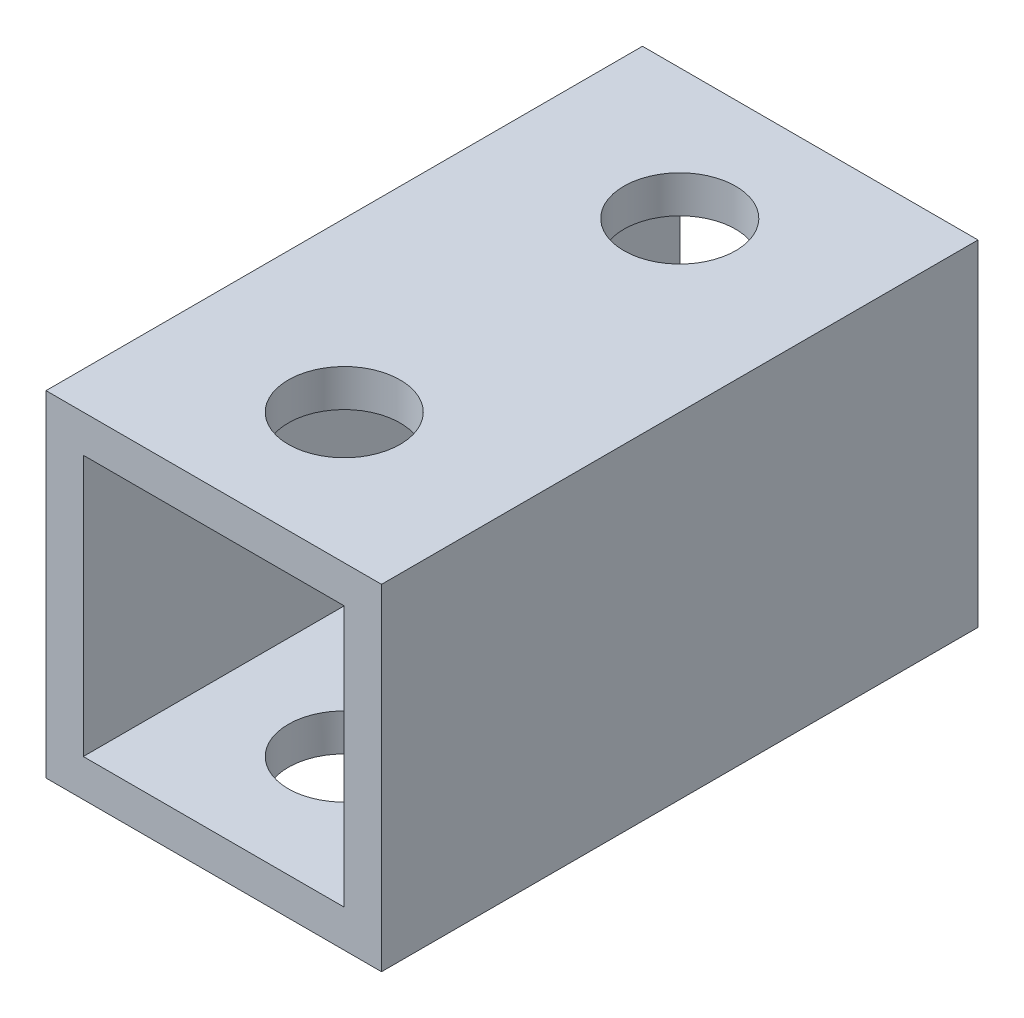
ISO-10303-21;
HEADER;
FILE_DESCRIPTION(('STEP AP214'),'2;1');
FILE_NAME('part.step','',(''),(''),'','','');
FILE_SCHEMA(('AUTOMOTIVE_DESIGN { 1 0 10303 214 1 1 1 1 }'));
ENDSEC;
DATA;
#1=APPLICATION_CONTEXT('core data for automotive mechanical design processes');
#2=APPLICATION_PROTOCOL_DEFINITION('international standard','automotive_design',2000,#1);
#3=PRODUCT_CONTEXT('',#1,'mechanical');
#4=PRODUCT('Part','Part','',(#3));
#5=PRODUCT_RELATED_PRODUCT_CATEGORY('part','',(#4));
#6=PRODUCT_DEFINITION_FORMATION('','',#4);
#7=PRODUCT_DEFINITION_CONTEXT('part definition',#1,'design');
#8=PRODUCT_DEFINITION('design','',#6,#7);
#9=PRODUCT_DEFINITION_SHAPE('','',#8);
#10=(LENGTH_UNIT() NAMED_UNIT(*) SI_UNIT(.MILLI.,.METRE.));
#11=(NAMED_UNIT(*) PLANE_ANGLE_UNIT() SI_UNIT($,.RADIAN.));
#12=(NAMED_UNIT(*) SI_UNIT($,.STERADIAN.) SOLID_ANGLE_UNIT());
#13=UNCERTAINTY_MEASURE_WITH_UNIT(LENGTH_MEASURE(1.E-05),#10,'distance_accuracy_value','');
#14=(GEOMETRIC_REPRESENTATION_CONTEXT(3) GLOBAL_UNCERTAINTY_ASSIGNED_CONTEXT((#13)) GLOBAL_UNIT_ASSIGNED_CONTEXT((#10,
#11,#12)) REPRESENTATION_CONTEXT('',''));
#15=CARTESIAN_POINT('',(0.,0.,0.));
#16=DIRECTION('',(0.,0.,1.));
#17=DIRECTION('',(1.,0.,0.));
#18=AXIS2_PLACEMENT_3D('',#15,#16,#17);
#19=CARTESIAN_POINT('',(4.5,4.5,16.));
#20=DIRECTION('',(-1.,0.,0.));
#21=DIRECTION('',(0.,0.,1.));
#22=AXIS2_PLACEMENT_3D('',#19,#20,#21);
#23=PLANE('',#22);
#24=DIRECTION('',(0.,1.,0.));
#25=VECTOR('',#24,1.);
#26=CARTESIAN_POINT('',(4.5,4.5,0.));
#27=LINE('',#26,#25);
#28=CARTESIAN_POINT('',(4.5,-4.5,0.));
#29=VERTEX_POINT('',#28);
#30=CARTESIAN_POINT('',(4.5,4.5,0.));
#31=VERTEX_POINT('',#30);
#32=EDGE_CURVE('E126',#29,#31,#27,.T.);
#33=ORIENTED_EDGE('',*,*,#32,.T.);
#34=DIRECTION('',(0.,0.,-1.));
#35=VECTOR('',#34,1.);
#36=CARTESIAN_POINT('',(4.5,4.5,16.));
#37=LINE('',#36,#35);
#38=CARTESIAN_POINT('',(4.5,4.5,16.));
#39=VERTEX_POINT('',#38);
#40=EDGE_CURVE('E155',#39,#31,#37,.T.);
#41=ORIENTED_EDGE('',*,*,#40,.F.);
#42=DIRECTION('',(0.,1.,0.));
#43=VECTOR('',#42,1.);
#44=CARTESIAN_POINT('',(4.5,4.5,16.));
#45=LINE('',#44,#43);
#46=CARTESIAN_POINT('',(4.5,-4.5,16.));
#47=VERTEX_POINT('',#46);
#48=EDGE_CURVE('E129',#47,#39,#45,.T.);
#49=ORIENTED_EDGE('',*,*,#48,.F.);
#50=DIRECTION('',(0.,0.,-1.));
#51=VECTOR('',#50,1.);
#52=CARTESIAN_POINT('',(4.5,-4.5,16.));
#53=LINE('',#52,#51);
#54=EDGE_CURVE('E139',#47,#29,#53,.T.);
#55=ORIENTED_EDGE('',*,*,#54,.T.);
#56=EDGE_LOOP('',(#33,#41,#49,#55));
#57=FACE_BOUND('',#56,.T.);
#58=ADVANCED_FACE('F34',(#57),#23,.F.);
#59=CARTESIAN_POINT('',(-4.5,4.5,16.));
#60=DIRECTION('',(0.,-1.,0.));
#61=DIRECTION('',(0.,0.,-1.));
#62=AXIS2_PLACEMENT_3D('',#59,#60,#61);
#63=PLANE('',#62);
#64=CARTESIAN_POINT('',(0.,4.5,3.5));
#65=DIRECTION('',(0.,1.,0.));
#66=DIRECTION('',(0.,0.,1.));
#67=AXIS2_PLACEMENT_3D('',#64,#65,#66);
#68=CIRCLE('',#67,1.5);
#69=CARTESIAN_POINT('',(0.,4.5,5.));
#70=VERTEX_POINT('',#69);
#71=EDGE_CURVE('E165',#70,#70,#68,.T.);
#72=ORIENTED_EDGE('',*,*,#71,.F.);
#73=EDGE_LOOP('',(#72));
#74=FACE_BOUND('',#73,.T.);
#75=CARTESIAN_POINT('',(0.,4.5,12.5));
#76=DIRECTION('',(0.,1.,0.));
#77=DIRECTION('',(0.,0.,1.));
#78=AXIS2_PLACEMENT_3D('',#75,#76,#77);
#79=CIRCLE('',#78,1.49960509591332);
#80=CARTESIAN_POINT('',(0.,4.5,13.9996050959133));
#81=VERTEX_POINT('',#80);
#82=EDGE_CURVE('E172',#81,#81,#79,.T.);
#83=ORIENTED_EDGE('',*,*,#82,.F.);
#84=EDGE_LOOP('',(#83));
#85=FACE_BOUND('',#84,.T.);
#86=DIRECTION('',(-1.,0.,0.));
#87=VECTOR('',#86,1.);
#88=CARTESIAN_POINT('',(-4.5,4.5,0.));
#89=LINE('',#88,#87);
#90=CARTESIAN_POINT('',(-4.5,4.5,0.));
#91=VERTEX_POINT('',#90);
#92=EDGE_CURVE('E142',#31,#91,#89,.T.);
#93=ORIENTED_EDGE('',*,*,#92,.T.);
#94=DIRECTION('',(0.,0.,-1.));
#95=VECTOR('',#94,1.);
#96=CARTESIAN_POINT('',(-4.5,4.5,16.));
#97=LINE('',#96,#95);
#98=CARTESIAN_POINT('',(-4.5,4.5,16.));
#99=VERTEX_POINT('',#98);
#100=EDGE_CURVE('E152',#99,#91,#97,.T.);
#101=ORIENTED_EDGE('',*,*,#100,.F.);
#102=DIRECTION('',(-1.,0.,0.));
#103=VECTOR('',#102,1.);
#104=CARTESIAN_POINT('',(-4.5,4.5,16.));
#105=LINE('',#104,#103);
#106=EDGE_CURVE('E132',#39,#99,#105,.T.);
#107=ORIENTED_EDGE('',*,*,#106,.F.);
#108=ORIENTED_EDGE('',*,*,#40,.T.);
#109=EDGE_LOOP('',(#93,#101,#107,#108));
#110=FACE_BOUND('',#109,.T.);
#111=ADVANCED_FACE('F206',(#74,#85,#110),#63,.F.);
#112=CARTESIAN_POINT('',(-4.5,4.5,16.));
#113=DIRECTION('',(1.,0.,0.));
#114=DIRECTION('',(0.,1.,0.));
#115=AXIS2_PLACEMENT_3D('',#112,#113,#114);
#116=PLANE('',#115);
#117=DIRECTION('',(0.,-1.,0.));
#118=VECTOR('',#117,1.);
#119=CARTESIAN_POINT('',(-4.5,4.5,0.));
#120=LINE('',#119,#118);
#121=CARTESIAN_POINT('',(-4.5,-4.5,0.));
#122=VERTEX_POINT('',#121);
#123=EDGE_CURVE('E144',#91,#122,#120,.T.);
#124=ORIENTED_EDGE('',*,*,#123,.T.);
#125=DIRECTION('',(0.,0.,-1.));
#126=VECTOR('',#125,1.);
#127=CARTESIAN_POINT('',(-4.5,-4.5,16.));
#128=LINE('',#127,#126);
#129=CARTESIAN_POINT('',(-4.5,-4.5,16.));
#130=VERTEX_POINT('',#129);
#131=EDGE_CURVE('E149',#130,#122,#128,.T.);
#132=ORIENTED_EDGE('',*,*,#131,.F.);
#133=DIRECTION('',(0.,-1.,0.));
#134=VECTOR('',#133,1.);
#135=CARTESIAN_POINT('',(-4.5,4.5,16.));
#136=LINE('',#135,#134);
#137=EDGE_CURVE('E135',#99,#130,#136,.T.);
#138=ORIENTED_EDGE('',*,*,#137,.F.);
#139=ORIENTED_EDGE('',*,*,#100,.T.);
#140=EDGE_LOOP('',(#124,#132,#138,#139));
#141=FACE_BOUND('',#140,.T.);
#142=ADVANCED_FACE('F211',(#141),#116,.F.);
#143=CARTESIAN_POINT('',(-4.5,-4.5,16.));
#144=DIRECTION('',(0.,1.,0.));
#145=DIRECTION('',(0.,0.,1.));
#146=AXIS2_PLACEMENT_3D('',#143,#144,#145);
#147=PLANE('',#146);
#148=CARTESIAN_POINT('',(0.,-4.5,3.5));
#149=DIRECTION('',(0.,1.,0.));
#150=DIRECTION('',(0.,0.,1.));
#151=AXIS2_PLACEMENT_3D('',#148,#149,#150);
#152=CIRCLE('',#151,1.5);
#153=CARTESIAN_POINT('',(0.,-4.5,5.));
#154=VERTEX_POINT('',#153);
#155=EDGE_CURVE('E184',#154,#154,#152,.T.);
#156=ORIENTED_EDGE('',*,*,#155,.T.);
#157=EDGE_LOOP('',(#156));
#158=FACE_BOUND('',#157,.T.);
#159=CARTESIAN_POINT('',(0.,-4.5,12.5));
#160=DIRECTION('',(0.,1.,0.));
#161=DIRECTION('',(0.,0.,1.));
#162=AXIS2_PLACEMENT_3D('',#159,#160,#161);
#163=CIRCLE('',#162,1.49960509591332);
#164=CARTESIAN_POINT('',(0.,-4.5,13.9996050959133));
#165=VERTEX_POINT('',#164);
#166=EDGE_CURVE('E169',#165,#165,#163,.T.);
#167=ORIENTED_EDGE('',*,*,#166,.T.);
#168=EDGE_LOOP('',(#167));
#169=FACE_BOUND('',#168,.T.);
#170=DIRECTION('',(1.,0.,0.));
#171=VECTOR('',#170,1.);
#172=CARTESIAN_POINT('',(-4.5,-4.5,0.));
#173=LINE('',#172,#171);
#174=EDGE_CURVE('E133',#122,#29,#173,.T.);
#175=ORIENTED_EDGE('',*,*,#174,.T.);
#176=ORIENTED_EDGE('',*,*,#54,.F.);
#177=DIRECTION('',(1.,0.,0.));
#178=VECTOR('',#177,1.);
#179=CARTESIAN_POINT('',(-4.5,-4.5,16.));
#180=LINE('',#179,#178);
#181=EDGE_CURVE('E137',#130,#47,#180,.T.);
#182=ORIENTED_EDGE('',*,*,#181,.F.);
#183=ORIENTED_EDGE('',*,*,#131,.T.);
#184=EDGE_LOOP('',(#175,#176,#182,#183));
#185=FACE_BOUND('',#184,.T.);
#186=ADVANCED_FACE('F188',(#158,#169,#185),#147,.F.);
#187=CARTESIAN_POINT('',(0.,0.,16.));
#188=DIRECTION('',(0.,0.,1.));
#189=DIRECTION('',(1.,0.,0.));
#190=AXIS2_PLACEMENT_3D('',#187,#188,#189);
#191=PLANE('',#190);
#192=DIRECTION('',(0.,1.,0.));
#193=VECTOR('',#192,1.);
#194=CARTESIAN_POINT('',(3.5,3.5,16.));
#195=LINE('',#194,#193);
#196=CARTESIAN_POINT('',(3.5,-3.5,16.));
#197=VERTEX_POINT('',#196);
#198=CARTESIAN_POINT('',(3.5,3.5,16.));
#199=VERTEX_POINT('',#198);
#200=EDGE_CURVE('E50',#197,#199,#195,.T.);
#201=ORIENTED_EDGE('',*,*,#200,.F.);
#202=DIRECTION('',(1.,0.,0.));
#203=VECTOR('',#202,1.);
#204=CARTESIAN_POINT('',(-3.5,-3.5,16.));
#205=LINE('',#204,#203);
#206=CARTESIAN_POINT('',(-3.5,-3.5,16.));
#207=VERTEX_POINT('',#206);
#208=EDGE_CURVE('E119',#207,#197,#205,.T.);
#209=ORIENTED_EDGE('',*,*,#208,.F.);
#210=DIRECTION('',(0.,-1.,0.));
#211=VECTOR('',#210,1.);
#212=CARTESIAN_POINT('',(-3.5,3.5,16.));
#213=LINE('',#212,#211);
#214=CARTESIAN_POINT('',(-3.5,3.5,16.));
#215=VERTEX_POINT('',#214);
#216=EDGE_CURVE('E103',#215,#207,#213,.T.);
#217=ORIENTED_EDGE('',*,*,#216,.F.);
#218=DIRECTION('',(-1.,0.,0.));
#219=VECTOR('',#218,1.);
#220=CARTESIAN_POINT('',(-3.5,3.5,16.));
#221=LINE('',#220,#219);
#222=EDGE_CURVE('E112',#199,#215,#221,.T.);
#223=ORIENTED_EDGE('',*,*,#222,.F.);
#224=EDGE_LOOP('',(#201,#209,#217,#223));
#225=FACE_BOUND('',#224,.T.);
#226=ORIENTED_EDGE('',*,*,#48,.T.);
#227=ORIENTED_EDGE('',*,*,#106,.T.);
#228=ORIENTED_EDGE('',*,*,#137,.T.);
#229=ORIENTED_EDGE('',*,*,#181,.T.);
#230=EDGE_LOOP('',(#226,#227,#228,#229));
#231=FACE_BOUND('',#230,.T.);
#232=ADVANCED_FACE('F116',(#225,#231),#191,.T.);
#233=CARTESIAN_POINT('',(0.,0.,0.));
#234=DIRECTION('',(0.,0.,1.));
#235=DIRECTION('',(1.,0.,0.));
#236=AXIS2_PLACEMENT_3D('',#233,#234,#235);
#237=PLANE('',#236);
#238=DIRECTION('',(1.,0.,0.));
#239=VECTOR('',#238,1.);
#240=CARTESIAN_POINT('',(0.,-3.5,0.));
#241=LINE('',#240,#239);
#242=CARTESIAN_POINT('',(-3.5,-3.5,0.));
#243=VERTEX_POINT('',#242);
#244=CARTESIAN_POINT('',(3.5,-3.5,0.));
#245=VERTEX_POINT('',#244);
#246=EDGE_CURVE('E42',#243,#245,#241,.T.);
#247=ORIENTED_EDGE('',*,*,#246,.T.);
#248=DIRECTION('',(0.,1.,0.));
#249=VECTOR('',#248,1.);
#250=CARTESIAN_POINT('',(3.5,0.,0.));
#251=LINE('',#250,#249);
#252=CARTESIAN_POINT('',(3.5,3.5,0.));
#253=VERTEX_POINT('',#252);
#254=EDGE_CURVE('E11',#245,#253,#251,.T.);
#255=ORIENTED_EDGE('',*,*,#254,.T.);
#256=DIRECTION('',(-1.,0.,0.));
#257=VECTOR('',#256,1.);
#258=CARTESIAN_POINT('',(0.,3.5,0.));
#259=LINE('',#258,#257);
#260=CARTESIAN_POINT('',(-3.5,3.5,0.));
#261=VERTEX_POINT('',#260);
#262=EDGE_CURVE('E158',#253,#261,#259,.T.);
#263=ORIENTED_EDGE('',*,*,#262,.T.);
#264=DIRECTION('',(0.,-1.,0.));
#265=VECTOR('',#264,1.);
#266=CARTESIAN_POINT('',(-3.5,0.,0.));
#267=LINE('',#266,#265);
#268=EDGE_CURVE('E106',#261,#243,#267,.T.);
#269=ORIENTED_EDGE('',*,*,#268,.T.);
#270=EDGE_LOOP('',(#247,#255,#263,#269));
#271=FACE_BOUND('',#270,.T.);
#272=ORIENTED_EDGE('',*,*,#32,.F.);
#273=ORIENTED_EDGE('',*,*,#174,.F.);
#274=ORIENTED_EDGE('',*,*,#123,.F.);
#275=ORIENTED_EDGE('',*,*,#92,.F.);
#276=EDGE_LOOP('',(#272,#273,#274,#275));
#277=FACE_BOUND('',#276,.T.);
#278=ADVANCED_FACE('F219',(#271,#277),#237,.F.);
#279=CARTESIAN_POINT('',(3.5,3.5,-4.));
#280=DIRECTION('',(1.,0.,0.));
#281=DIRECTION('',(0.,1.,0.));
#282=AXIS2_PLACEMENT_3D('',#279,#280,#281);
#283=PLANE('',#282);
#284=DIRECTION('',(0.,0.,1.));
#285=VECTOR('',#284,1.);
#286=CARTESIAN_POINT('',(3.5,-3.5,-4.));
#287=LINE('',#286,#285);
#288=EDGE_CURVE('E124',#245,#197,#287,.T.);
#289=ORIENTED_EDGE('',*,*,#288,.T.);
#290=ORIENTED_EDGE('',*,*,#200,.T.);
#291=DIRECTION('',(0.,0.,1.));
#292=VECTOR('',#291,1.);
#293=CARTESIAN_POINT('',(3.5,3.5,-4.));
#294=LINE('',#293,#292);
#295=EDGE_CURVE('E109',#253,#199,#294,.T.);
#296=ORIENTED_EDGE('',*,*,#295,.F.);
#297=ORIENTED_EDGE('',*,*,#254,.F.);
#298=EDGE_LOOP('',(#289,#290,#296,#297));
#299=FACE_BOUND('',#298,.T.);
#300=ADVANCED_FACE('F237',(#299),#283,.F.);
#301=CARTESIAN_POINT('',(-3.5,-3.5,-4.));
#302=DIRECTION('',(0.,-1.,0.));
#303=DIRECTION('',(0.,0.,-1.));
#304=AXIS2_PLACEMENT_3D('',#301,#302,#303);
#305=PLANE('',#304);
#306=CARTESIAN_POINT('',(0.,-3.5,3.5));
#307=DIRECTION('',(0.,-1.,0.));
#308=DIRECTION('',(0.,0.,-1.));
#309=AXIS2_PLACEMENT_3D('',#306,#307,#308);
#310=CIRCLE('',#309,1.5);
#311=CARTESIAN_POINT('',(0.,-3.5,2.));
#312=VERTEX_POINT('',#311);
#313=EDGE_CURVE('E181',#312,#312,#310,.T.);
#314=ORIENTED_EDGE('',*,*,#313,.T.);
#315=EDGE_LOOP('',(#314));
#316=FACE_BOUND('',#315,.T.);
#317=CARTESIAN_POINT('',(0.,-3.5,12.5));
#318=DIRECTION('',(0.,-1.,0.));
#319=DIRECTION('',(0.,0.,-1.));
#320=AXIS2_PLACEMENT_3D('',#317,#318,#319);
#321=CIRCLE('',#320,1.49960509591332);
#322=CARTESIAN_POINT('',(0.,-3.5,11.0003949040867));
#323=VERTEX_POINT('',#322);
#324=EDGE_CURVE('E164',#323,#323,#321,.T.);
#325=ORIENTED_EDGE('',*,*,#324,.T.);
#326=EDGE_LOOP('',(#325));
#327=FACE_BOUND('',#326,.T.);
#328=DIRECTION('',(0.,0.,1.));
#329=VECTOR('',#328,1.);
#330=CARTESIAN_POINT('',(-3.5,-3.5,-4.));
#331=LINE('',#330,#329);
#332=EDGE_CURVE('E108',#243,#207,#331,.T.);
#333=ORIENTED_EDGE('',*,*,#332,.T.);
#334=ORIENTED_EDGE('',*,*,#208,.T.);
#335=ORIENTED_EDGE('',*,*,#288,.F.);
#336=ORIENTED_EDGE('',*,*,#246,.F.);
#337=EDGE_LOOP('',(#333,#334,#335,#336));
#338=FACE_BOUND('',#337,.T.);
#339=ADVANCED_FACE('F243',(#316,#327,#338),#305,.F.);
#340=CARTESIAN_POINT('',(-3.5,3.5,-4.));
#341=DIRECTION('',(-1.,0.,0.));
#342=DIRECTION('',(0.,-1.,0.));
#343=AXIS2_PLACEMENT_3D('',#340,#341,#342);
#344=PLANE('',#343);
#345=DIRECTION('',(0.,0.,1.));
#346=VECTOR('',#345,1.);
#347=CARTESIAN_POINT('',(-3.5,3.5,-4.));
#348=LINE('',#347,#346);
#349=EDGE_CURVE('E58',#261,#215,#348,.T.);
#350=ORIENTED_EDGE('',*,*,#349,.T.);
#351=ORIENTED_EDGE('',*,*,#216,.T.);
#352=ORIENTED_EDGE('',*,*,#332,.F.);
#353=ORIENTED_EDGE('',*,*,#268,.F.);
#354=EDGE_LOOP('',(#350,#351,#352,#353));
#355=FACE_BOUND('',#354,.T.);
#356=ADVANCED_FACE('F100',(#355),#344,.F.);
#357=CARTESIAN_POINT('',(-3.5,3.5,-4.));
#358=DIRECTION('',(0.,1.,0.));
#359=DIRECTION('',(0.,0.,1.));
#360=AXIS2_PLACEMENT_3D('',#357,#358,#359);
#361=PLANE('',#360);
#362=CARTESIAN_POINT('',(0.,3.5,3.5));
#363=DIRECTION('',(0.,1.,0.));
#364=DIRECTION('',(0.,0.,1.));
#365=AXIS2_PLACEMENT_3D('',#362,#363,#364);
#366=CIRCLE('',#365,1.5);
#367=CARTESIAN_POINT('',(0.,3.5,5.));
#368=VERTEX_POINT('',#367);
#369=EDGE_CURVE('E37',#368,#368,#366,.T.);
#370=ORIENTED_EDGE('',*,*,#369,.T.);
#371=EDGE_LOOP('',(#370));
#372=FACE_BOUND('',#371,.T.);
#373=CARTESIAN_POINT('',(0.,3.5,12.5));
#374=DIRECTION('',(0.,1.,0.));
#375=DIRECTION('',(0.,0.,1.));
#376=AXIS2_PLACEMENT_3D('',#373,#374,#375);
#377=CIRCLE('',#376,1.49960509591332);
#378=CARTESIAN_POINT('',(0.,3.5,13.9996050959133));
#379=VERTEX_POINT('',#378);
#380=EDGE_CURVE('E162',#379,#379,#377,.T.);
#381=ORIENTED_EDGE('',*,*,#380,.T.);
#382=EDGE_LOOP('',(#381));
#383=FACE_BOUND('',#382,.T.);
#384=ORIENTED_EDGE('',*,*,#295,.T.);
#385=ORIENTED_EDGE('',*,*,#222,.T.);
#386=ORIENTED_EDGE('',*,*,#349,.F.);
#387=ORIENTED_EDGE('',*,*,#262,.F.);
#388=EDGE_LOOP('',(#384,#385,#386,#387));
#389=FACE_BOUND('',#388,.T.);
#390=ADVANCED_FACE('F113',(#372,#383,#389),#361,.F.);
#391=CARTESIAN_POINT('',(0.,-15.5,12.5));
#392=DIRECTION('',(0.,1.,0.));
#393=DIRECTION('',(0.,0.,1.));
#394=AXIS2_PLACEMENT_3D('',#391,#392,#393);
#395=CYLINDRICAL_SURFACE('',#394,1.49960509591332);
#396=ORIENTED_EDGE('',*,*,#82,.T.);
#397=EDGE_LOOP('',(#396));
#398=FACE_BOUND('',#397,.T.);
#399=ORIENTED_EDGE('',*,*,#380,.F.);
#400=EDGE_LOOP('',(#399));
#401=FACE_BOUND('',#400,.T.);
#402=ADVANCED_FACE('F202',(#398,#401),#395,.F.);
#403=CARTESIAN_POINT('',(0.,-15.5,3.5));
#404=DIRECTION('',(0.,1.,0.));
#405=DIRECTION('',(0.,0.,1.));
#406=AXIS2_PLACEMENT_3D('',#403,#404,#405);
#407=CYLINDRICAL_SURFACE('',#406,1.5);
#408=ORIENTED_EDGE('',*,*,#71,.T.);
#409=EDGE_LOOP('',(#408));
#410=FACE_BOUND('',#409,.T.);
#411=ORIENTED_EDGE('',*,*,#369,.F.);
#412=EDGE_LOOP('',(#411));
#413=FACE_BOUND('',#412,.T.);
#414=ADVANCED_FACE('F196',(#410,#413),#407,.F.);
#415=ORIENTED_EDGE('',*,*,#324,.F.);
#416=EDGE_LOOP('',(#415));
#417=FACE_BOUND('',#416,.T.);
#418=ORIENTED_EDGE('',*,*,#166,.F.);
#419=EDGE_LOOP('',(#418));
#420=FACE_BOUND('',#419,.T.);
#421=ADVANCED_FACE('F193',(#417,#420),#395,.F.);
#422=ORIENTED_EDGE('',*,*,#313,.F.);
#423=EDGE_LOOP('',(#422));
#424=FACE_BOUND('',#423,.T.);
#425=ORIENTED_EDGE('',*,*,#155,.F.);
#426=EDGE_LOOP('',(#425));
#427=FACE_BOUND('',#426,.T.);
#428=ADVANCED_FACE('F191',(#424,#427),#407,.F.);
#429=CLOSED_SHELL('',(#58,#111,#142,#186,#232,#278,#300,#339,#356,#390,#402,#414,#421,#428));
#430=MANIFOLD_SOLID_BREP('B2',#429);
#431=ADVANCED_BREP_SHAPE_REPRESENTATION('',(#18,#430),#14);
#432=SHAPE_DEFINITION_REPRESENTATION(#9,#431);
ENDSEC;
END-ISO-10303-21;
